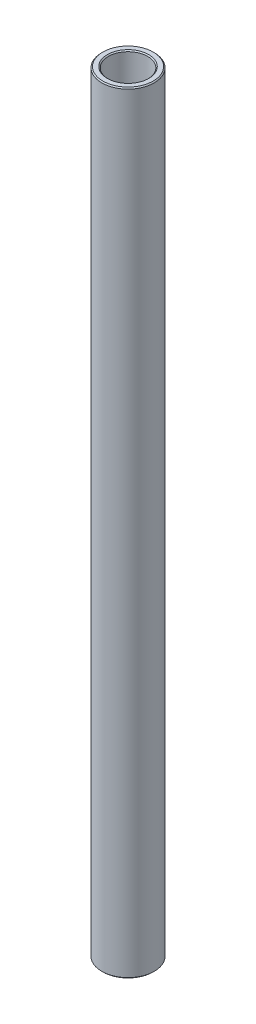
ISO-10303-21;
HEADER;
FILE_DESCRIPTION(('STEP AP214'),'2;1');
FILE_NAME('part.step','',(''),(''),'','','');
FILE_SCHEMA(('AUTOMOTIVE_DESIGN { 1 0 10303 214 1 1 1 1 }'));
ENDSEC;
DATA;
#1=APPLICATION_CONTEXT('core data for automotive mechanical design processes');
#2=APPLICATION_PROTOCOL_DEFINITION('international standard','automotive_design',2000,#1);
#3=PRODUCT_CONTEXT('',#1,'mechanical');
#4=PRODUCT('Part','Part','',(#3));
#5=PRODUCT_RELATED_PRODUCT_CATEGORY('part','',(#4));
#6=PRODUCT_DEFINITION_FORMATION('','',#4);
#7=PRODUCT_DEFINITION_CONTEXT('part definition',#1,'design');
#8=PRODUCT_DEFINITION('design','',#6,#7);
#9=PRODUCT_DEFINITION_SHAPE('','',#8);
#10=(LENGTH_UNIT() NAMED_UNIT(*) SI_UNIT(.MILLI.,.METRE.));
#11=(NAMED_UNIT(*) PLANE_ANGLE_UNIT() SI_UNIT($,.RADIAN.));
#12=(NAMED_UNIT(*) SI_UNIT($,.STERADIAN.) SOLID_ANGLE_UNIT());
#13=UNCERTAINTY_MEASURE_WITH_UNIT(LENGTH_MEASURE(1.E-05),#10,'distance_accuracy_value','');
#14=(GEOMETRIC_REPRESENTATION_CONTEXT(3) GLOBAL_UNCERTAINTY_ASSIGNED_CONTEXT((#13)) GLOBAL_UNIT_ASSIGNED_CONTEXT((#10,
#11,#12)) REPRESENTATION_CONTEXT('',''));
#15=CARTESIAN_POINT('',(0.,0.,0.));
#16=DIRECTION('',(0.,0.,1.));
#17=DIRECTION('',(1.,0.,0.));
#18=AXIS2_PLACEMENT_3D('',#15,#16,#17);
#19=CARTESIAN_POINT('',(6.3500000000003,126.364643080906,0.));
#20=DIRECTION('',(1.79374702498031E-12,-1.,0.));
#21=DIRECTION('',(1.,1.79374702498031E-12,0.));
#22=AXIS2_PLACEMENT_3D('',#19,#20,#21);
#23=PLANE('',#22);
#24=CARTESIAN_POINT('',(-1.70854404129195E-11,126.364643080895,0.));
#25=DIRECTION('',(1.79374702498031E-12,-1.,0.));
#26=DIRECTION('',(1.,1.79374702498031E-12,0.));
#27=AXIS2_PLACEMENT_3D('',#24,#25,#26);
#28=CIRCLE('',#27,5.01650000001856);
#29=CARTESIAN_POINT('',(5.01650000000148,126.364643080904,0.));
#30=VERTEX_POINT('',#29);
#31=EDGE_CURVE('E10',#30,#30,#28,.F.);
#32=ORIENTED_EDGE('',*,*,#31,.T.);
#33=EDGE_LOOP('',(#32));
#34=FACE_BOUND('',#33,.T.);
#35=CARTESIAN_POINT('',(-1.70854404129195E-11,126.364643080895,0.));
#36=DIRECTION('',(1.79374702498031E-12,-1.,0.));
#37=DIRECTION('',(1.,1.79374702498031E-12,0.));
#38=AXIS2_PLACEMENT_3D('',#35,#36,#37);
#39=CIRCLE('',#38,6.09600000001872);
#40=CARTESIAN_POINT('',(6.09600000000163,126.364643080906,0.));
#41=VERTEX_POINT('',#40);
#42=EDGE_CURVE('E38',#41,#41,#39,.T.);
#43=ORIENTED_EDGE('',*,*,#42,.T.);
#44=EDGE_LOOP('',(#43));
#45=FACE_BOUND('',#44,.T.);
#46=ADVANCED_FACE('F31',(#34,#45),#23,.T.);
#47=CARTESIAN_POINT('',(0.,116.839643080905,0.));
#48=DIRECTION('',(1.79374702498031E-12,-1.,0.));
#49=DIRECTION('',(1.,1.79374702498031E-12,0.));
#50=AXIS2_PLACEMENT_3D('',#47,#48,#49);
#51=CYLINDRICAL_SURFACE('',#50,4.76250000018473);
#52=CARTESIAN_POINT('',(-3.51885659286423E-10,313.0131582901,0.));
#53=DIRECTION('',(-1.79374702498044E-12,1.,0.));
#54=DIRECTION('',(-1.,-1.79374702498044E-12,0.));
#55=AXIS2_PLACEMENT_3D('',#52,#53,#54);
#56=CIRCLE('',#55,4.76250000018473);
#57=CARTESIAN_POINT('',(-4.76250000053661,313.013158290091,0.));
#58=VERTEX_POINT('',#57);
#59=EDGE_CURVE('E42',#58,#58,#56,.T.);
#60=ORIENTED_EDGE('',*,*,#59,.T.);
#61=EDGE_LOOP('',(#60));
#62=FACE_BOUND('',#61,.T.);
#63=CARTESIAN_POINT('',(-1.75410521569664E-11,126.618643080728,0.));
#64=DIRECTION('',(1.7937470249803E-12,-1.,0.));
#65=DIRECTION('',(1.,1.7937470249803E-12,0.));
#66=AXIS2_PLACEMENT_3D('',#63,#64,#65);
#67=CIRCLE('',#66,4.76250000018473);
#68=CARTESIAN_POINT('',(4.76250000016719,126.618643080737,0.));
#69=VERTEX_POINT('',#68);
#70=EDGE_CURVE('E46',#69,#69,#67,.T.);
#71=ORIENTED_EDGE('',*,*,#70,.T.);
#72=EDGE_LOOP('',(#71));
#73=FACE_BOUND('',#72,.T.);
#74=ADVANCED_FACE('F75',(#62,#73),#51,.F.);
#75=CARTESIAN_POINT('',(4.76250000000001,313.267158290274,0.));
#76=DIRECTION('',(-1.79374702498031E-12,1.,0.));
#77=DIRECTION('',(-1.,-1.79374702498031E-12,0.));
#78=AXIS2_PLACEMENT_3D('',#75,#76,#77);
#79=PLANE('',#78);
#80=CARTESIAN_POINT('',(-3.52341271031066E-10,313.267158290266,0.));
#81=DIRECTION('',(-1.79374702498031E-12,1.,0.));
#82=DIRECTION('',(-1.,-1.79374702498031E-12,0.));
#83=AXIS2_PLACEMENT_3D('',#80,#81,#82);
#84=CIRCLE('',#83,6.09600000035118);
#85=CARTESIAN_POINT('',(-6.09600000070352,313.267158290255,0.));
#86=VERTEX_POINT('',#85);
#87=EDGE_CURVE('E51',#86,#86,#84,.T.);
#88=ORIENTED_EDGE('',*,*,#87,.T.);
#89=EDGE_LOOP('',(#88));
#90=FACE_BOUND('',#89,.T.);
#91=CARTESIAN_POINT('',(-3.52341271031066E-10,313.267158290266,0.));
#92=DIRECTION('',(-1.79374702498031E-12,1.,0.));
#93=DIRECTION('',(-1.,-1.79374702498031E-12,0.));
#94=AXIS2_PLACEMENT_3D('',#91,#92,#93);
#95=CIRCLE('',#94,5.01650000035088);
#96=CARTESIAN_POINT('',(-5.01650000070322,313.267158290257,0.));
#97=VERTEX_POINT('',#96);
#98=EDGE_CURVE('E54',#97,#97,#95,.F.);
#99=ORIENTED_EDGE('',*,*,#98,.T.);
#100=EDGE_LOOP('',(#99));
#101=FACE_BOUND('',#100,.T.);
#102=ADVANCED_FACE('F80',(#90,#101),#79,.T.);
#103=CARTESIAN_POINT('',(0.,116.839643080905,0.));
#104=DIRECTION('',(1.79374702498031E-12,-1.,0.));
#105=DIRECTION('',(1.,1.79374702498031E-12,0.));
#106=AXIS2_PLACEMENT_3D('',#103,#104,#105);
#107=CYLINDRICAL_SURFACE('',#106,6.350000000185);
#108=CARTESIAN_POINT('',(-3.51885659287019E-10,313.013158290432,0.));
#109=DIRECTION('',(-1.79374702498041E-12,1.,0.));
#110=DIRECTION('',(-1.,-1.79374702498041E-12,0.));
#111=AXIS2_PLACEMENT_3D('',#108,#109,#110);
#112=CIRCLE('',#111,6.350000000185);
#113=CARTESIAN_POINT('',(-6.35000000053689,313.013158290421,0.));
#114=VERTEX_POINT('',#113);
#115=EDGE_CURVE('E57',#114,#114,#112,.F.);
#116=ORIENTED_EDGE('',*,*,#115,.T.);
#117=EDGE_LOOP('',(#116));
#118=FACE_BOUND('',#117,.T.);
#119=CARTESIAN_POINT('',(-1.75410521575628E-11,126.618643081061,0.));
#120=DIRECTION('',(1.7937470249803E-12,-1.,0.));
#121=DIRECTION('',(1.,1.7937470249803E-12,0.));
#122=AXIS2_PLACEMENT_3D('',#119,#120,#121);
#123=CIRCLE('',#122,6.350000000185);
#124=CARTESIAN_POINT('',(6.35000000016746,126.618643081072,0.));
#125=VERTEX_POINT('',#124);
#126=EDGE_CURVE('E60',#125,#125,#123,.F.);
#127=ORIENTED_EDGE('',*,*,#126,.T.);
#128=EDGE_LOOP('',(#127));
#129=FACE_BOUND('',#128,.T.);
#130=ADVANCED_FACE('F64',(#118,#129),#107,.T.);
#131=CARTESIAN_POINT('',(-3.51885659287019E-10,313.013158290432,0.));
#132=DIRECTION('',(1.79374702498041E-12,-1.,0.));
#133=DIRECTION('',(1.,1.79374702498041E-12,0.));
#134=AXIS2_PLACEMENT_3D('',#131,#132,#133);
#135=CONICAL_SURFACE('',#134,6.350000000185,0.785398163397428);
#136=ORIENTED_EDGE('',*,*,#87,.F.);
#137=EDGE_LOOP('',(#136));
#138=FACE_BOUND('',#137,.T.);
#139=ORIENTED_EDGE('',*,*,#115,.F.);
#140=EDGE_LOOP('',(#139));
#141=FACE_BOUND('',#140,.T.);
#142=ADVANCED_FACE('F85',(#138,#141),#135,.T.);
#143=CARTESIAN_POINT('',(-3.52341271031066E-10,313.267158290266,0.));
#144=DIRECTION('',(-1.79374702498044E-12,1.,0.));
#145=DIRECTION('',(-1.,-1.79374702498044E-12,0.));
#146=AXIS2_PLACEMENT_3D('',#143,#144,#145);
#147=CONICAL_SURFACE('',#146,5.01650000035087,0.7853981633975);
#148=ORIENTED_EDGE('',*,*,#59,.F.);
#149=EDGE_LOOP('',(#148));
#150=FACE_BOUND('',#149,.T.);
#151=ORIENTED_EDGE('',*,*,#98,.F.);
#152=EDGE_LOOP('',(#151));
#153=FACE_BOUND('',#152,.T.);
#154=ADVANCED_FACE('F72',(#150,#153),#147,.F.);
#155=CARTESIAN_POINT('',(-1.75410521569664E-11,126.618643080728,0.));
#156=DIRECTION('',(1.7937470249803E-12,-1.,0.));
#157=DIRECTION('',(1.,1.7937470249803E-12,0.));
#158=AXIS2_PLACEMENT_3D('',#155,#156,#157);
#159=CONICAL_SURFACE('',#158,4.76250000018473,0.785398163397493);
#160=ORIENTED_EDGE('',*,*,#31,.F.);
#161=EDGE_LOOP('',(#160));
#162=FACE_BOUND('',#161,.T.);
#163=ORIENTED_EDGE('',*,*,#70,.F.);
#164=EDGE_LOOP('',(#163));
#165=FACE_BOUND('',#164,.T.);
#166=ADVANCED_FACE('F68',(#162,#165),#159,.F.);
#167=CARTESIAN_POINT('',(-1.70854404129195E-11,126.364643080895,0.));
#168=DIRECTION('',(-1.7937470249803E-12,1.,0.));
#169=DIRECTION('',(-1.,-1.7937470249803E-12,0.));
#170=AXIS2_PLACEMENT_3D('',#167,#168,#169);
#171=CONICAL_SURFACE('',#170,6.09600000001873,0.785398163397482);
#172=ORIENTED_EDGE('',*,*,#126,.F.);
#173=EDGE_LOOP('',(#172));
#174=FACE_BOUND('',#173,.T.);
#175=ORIENTED_EDGE('',*,*,#42,.F.);
#176=EDGE_LOOP('',(#175));
#177=FACE_BOUND('',#176,.T.);
#178=ADVANCED_FACE('F33',(#174,#177),#171,.T.);
#179=CLOSED_SHELL('',(#46,#74,#102,#130,#142,#154,#166,#178));
#180=MANIFOLD_SOLID_BREP('B2',#179);
#181=ADVANCED_BREP_SHAPE_REPRESENTATION('',(#18,#180),#14);
#182=SHAPE_DEFINITION_REPRESENTATION(#9,#181);
ENDSEC;
END-ISO-10303-21;
